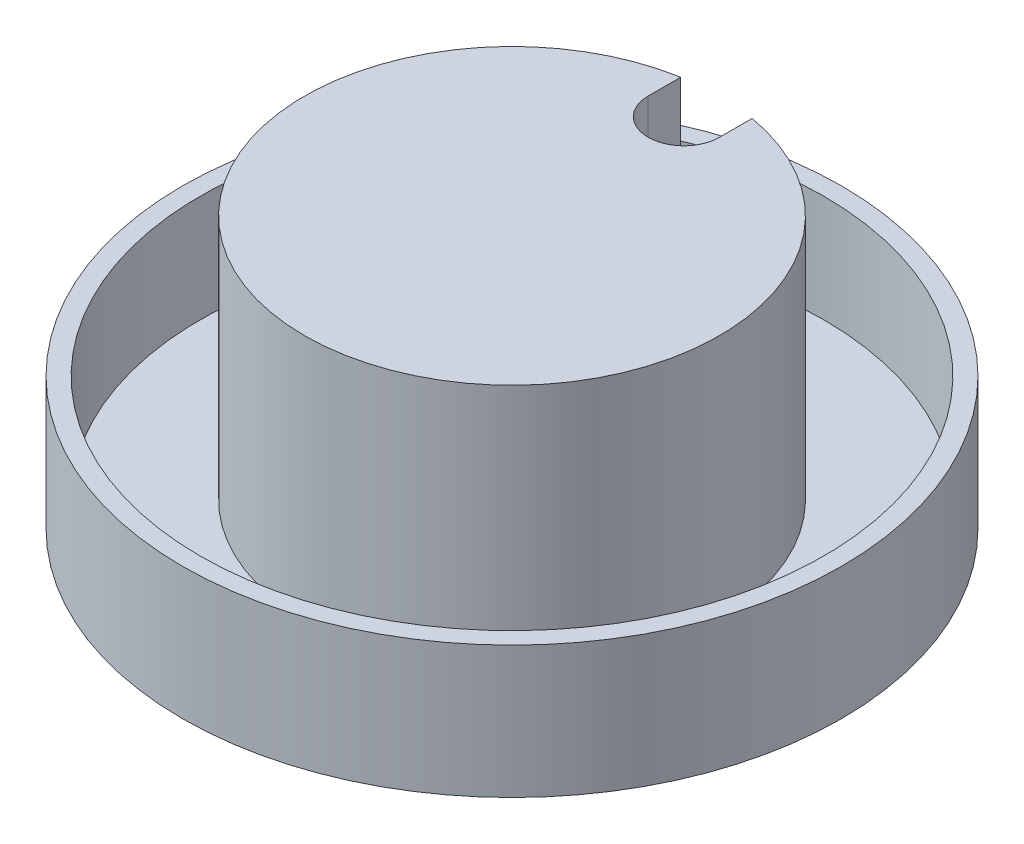
ISO-10303-21;
HEADER;
FILE_DESCRIPTION(('STEP AP214'),'2;1');
FILE_NAME('part.step','',(''),(''),'','','');
FILE_SCHEMA(('AUTOMOTIVE_DESIGN { 1 0 10303 214 1 1 1 1 }'));
ENDSEC;
DATA;
#1=APPLICATION_CONTEXT('core data for automotive mechanical design processes');
#2=APPLICATION_PROTOCOL_DEFINITION('international standard','automotive_design',2000,#1);
#3=PRODUCT_CONTEXT('',#1,'mechanical');
#4=PRODUCT('Part','Part','',(#3));
#5=PRODUCT_RELATED_PRODUCT_CATEGORY('part','',(#4));
#6=PRODUCT_DEFINITION_FORMATION('','',#4);
#7=PRODUCT_DEFINITION_CONTEXT('part definition',#1,'design');
#8=PRODUCT_DEFINITION('design','',#6,#7);
#9=PRODUCT_DEFINITION_SHAPE('','',#8);
#10=(LENGTH_UNIT() NAMED_UNIT(*) SI_UNIT(.MILLI.,.METRE.));
#11=(NAMED_UNIT(*) PLANE_ANGLE_UNIT() SI_UNIT($,.RADIAN.));
#12=(NAMED_UNIT(*) SI_UNIT($,.STERADIAN.) SOLID_ANGLE_UNIT());
#13=UNCERTAINTY_MEASURE_WITH_UNIT(LENGTH_MEASURE(1.E-05),#10,'distance_accuracy_value','');
#14=(GEOMETRIC_REPRESENTATION_CONTEXT(3) GLOBAL_UNCERTAINTY_ASSIGNED_CONTEXT((#13)) GLOBAL_UNIT_ASSIGNED_CONTEXT((#10,
#11,#12)) REPRESENTATION_CONTEXT('',''));
#15=CARTESIAN_POINT('',(0.,0.,0.));
#16=DIRECTION('',(0.,0.,1.));
#17=DIRECTION('',(1.,0.,0.));
#18=AXIS2_PLACEMENT_3D('',#15,#16,#17);
#19=CARTESIAN_POINT('',(-3.4,-8.659999892,-10.35));
#20=DIRECTION('',(1.,0.,0.));
#21=DIRECTION('',(0.,0.,-1.));
#22=AXIS2_PLACEMENT_3D('',#19,#20,#21);
#23=PLANE('',#22);
#24=DIRECTION('',(0.,0.,-1.));
#25=VECTOR('',#24,1.);
#26=CARTESIAN_POINT('',(-3.4,0.,-10.35));
#27=LINE('',#26,#25);
#28=CARTESIAN_POINT('',(-3.4,0.,-10.35));
#29=VERTEX_POINT('',#28);
#30=CARTESIAN_POINT('',(-3.4,0.,-11.0877761570414));
#31=VERTEX_POINT('',#30);
#32=EDGE_CURVE('E154',#29,#31,#27,.T.);
#33=ORIENTED_EDGE('',*,*,#32,.F.);
#34=DIRECTION('',(0.,1.,0.));
#35=VECTOR('',#34,1.);
#36=CARTESIAN_POINT('',(-3.4,-8.659999892,-10.35));
#37=LINE('',#36,#35);
#38=CARTESIAN_POINT('',(-3.4,14.809999892,-10.35));
#39=VERTEX_POINT('',#38);
#40=EDGE_CURVE('E163',#29,#39,#37,.T.);
#41=ORIENTED_EDGE('',*,*,#40,.T.);
#42=DIRECTION('',(0.,0.,-1.));
#43=VECTOR('',#42,1.);
#44=CARTESIAN_POINT('',(-3.4,14.809999892,-10.35));
#45=LINE('',#44,#43);
#46=CARTESIAN_POINT('',(-3.4,14.809999892,-11.0877761570414));
#47=VERTEX_POINT('',#46);
#48=EDGE_CURVE('E238',#39,#47,#45,.T.);
#49=ORIENTED_EDGE('',*,*,#48,.T.);
#50=DIRECTION('',(0.,-1.,0.));
#51=VECTOR('',#50,1.);
#52=CARTESIAN_POINT('',(-3.4,14.809999892,-11.0877761570414));
#53=LINE('',#52,#51);
#54=EDGE_CURVE('E165',#47,#31,#53,.T.);
#55=ORIENTED_EDGE('',*,*,#54,.T.);
#56=EDGE_LOOP('',(#33,#41,#49,#55));
#57=FACE_BOUND('',#56,.T.);
#58=ADVANCED_FACE('F69',(#57),#23,.F.);
#59=CARTESIAN_POINT('',(3.4,-8.659999892,-10.35));
#60=DIRECTION('',(1.,0.,0.));
#61=DIRECTION('',(0.,0.,-1.));
#62=AXIS2_PLACEMENT_3D('',#59,#60,#61);
#63=PLANE('',#62);
#64=DIRECTION('',(0.,1.,0.));
#65=VECTOR('',#64,1.);
#66=CARTESIAN_POINT('',(3.4,-8.659999892,-10.35));
#67=LINE('',#66,#65);
#68=CARTESIAN_POINT('',(3.4,0.,-10.35));
#69=VERTEX_POINT('',#68);
#70=CARTESIAN_POINT('',(3.4,14.809999892,-10.35));
#71=VERTEX_POINT('',#70);
#72=EDGE_CURVE('E174',#69,#71,#67,.T.);
#73=ORIENTED_EDGE('',*,*,#72,.F.);
#74=DIRECTION('',(0.,0.,-1.));
#75=VECTOR('',#74,1.);
#76=CARTESIAN_POINT('',(3.4,0.,-10.35));
#77=LINE('',#76,#75);
#78=CARTESIAN_POINT('',(3.4,0.,-11.0877761570414));
#79=VERTEX_POINT('',#78);
#80=EDGE_CURVE('E156',#69,#79,#77,.T.);
#81=ORIENTED_EDGE('',*,*,#80,.T.);
#82=DIRECTION('',(0.,-1.,0.));
#83=VECTOR('',#82,1.);
#84=CARTESIAN_POINT('',(3.4,14.809999892,-11.0877761570414));
#85=LINE('',#84,#83);
#86=CARTESIAN_POINT('',(3.4,14.809999892,-11.0877761570414));
#87=VERTEX_POINT('',#86);
#88=EDGE_CURVE('E191',#87,#79,#85,.T.);
#89=ORIENTED_EDGE('',*,*,#88,.F.);
#90=DIRECTION('',(0.,0.,-1.));
#91=VECTOR('',#90,1.);
#92=CARTESIAN_POINT('',(3.4,14.809999892,-10.35));
#93=LINE('',#92,#91);
#94=EDGE_CURVE('E235',#71,#87,#93,.T.);
#95=ORIENTED_EDGE('',*,*,#94,.F.);
#96=EDGE_LOOP('',(#73,#81,#89,#95));
#97=FACE_BOUND('',#96,.T.);
#98=ADVANCED_FACE('F275',(#97),#63,.T.);
#99=CARTESIAN_POINT('',(-2.15,-8.659999892,-10.35));
#100=DIRECTION('',(1.,0.,0.));
#101=DIRECTION('',(0.,0.,-1.));
#102=AXIS2_PLACEMENT_3D('',#99,#100,#101);
#103=PLANE('',#102);
#104=DIRECTION('',(0.,1.,0.));
#105=VECTOR('',#104,1.);
#106=CARTESIAN_POINT('',(-2.15,-8.659999892,-10.35));
#107=LINE('',#106,#105);
#108=CARTESIAN_POINT('',(-2.15,0.,-10.35));
#109=VERTEX_POINT('',#108);
#110=CARTESIAN_POINT('',(-2.15,16.31,-10.35));
#111=VERTEX_POINT('',#110);
#112=EDGE_CURVE('E224',#109,#111,#107,.T.);
#113=ORIENTED_EDGE('',*,*,#112,.F.);
#114=DIRECTION('',(0.,0.,1.));
#115=VECTOR('',#114,1.);
#116=CARTESIAN_POINT('',(-2.15,0.,-10.35));
#117=LINE('',#116,#115);
#118=CARTESIAN_POINT('',(-2.15,0.,-12.5));
#119=VERTEX_POINT('',#118);
#120=EDGE_CURVE('E247',#119,#109,#117,.T.);
#121=ORIENTED_EDGE('',*,*,#120,.F.);
#122=DIRECTION('',(0.,1.,0.));
#123=VECTOR('',#122,1.);
#124=CARTESIAN_POINT('',(-2.15,-8.659999892,-12.5));
#125=LINE('',#124,#123);
#126=CARTESIAN_POINT('',(-2.15,1.5,-12.5));
#127=VERTEX_POINT('',#126);
#128=EDGE_CURVE('E227',#119,#127,#125,.T.);
#129=ORIENTED_EDGE('',*,*,#128,.T.);
#130=DIRECTION('',(0.,0.,1.));
#131=VECTOR('',#130,1.);
#132=CARTESIAN_POINT('',(-2.15,1.5,-10.35));
#133=LINE('',#132,#131);
#134=CARTESIAN_POINT('',(-2.15,1.5,-12.3137118692943));
#135=VERTEX_POINT('',#134);
#136=EDGE_CURVE('E215',#127,#135,#133,.T.);
#137=ORIENTED_EDGE('',*,*,#136,.T.);
#138=DIRECTION('',(0.,1.,0.));
#139=VECTOR('',#138,1.);
#140=CARTESIAN_POINT('',(-2.15,1.5,-12.3137118692943));
#141=LINE('',#140,#139);
#142=CARTESIAN_POINT('',(-2.15,16.31,-12.3137118692943));
#143=VERTEX_POINT('',#142);
#144=EDGE_CURVE('E244',#135,#143,#141,.T.);
#145=ORIENTED_EDGE('',*,*,#144,.T.);
#146=DIRECTION('',(0.,0.,-1.));
#147=VECTOR('',#146,1.);
#148=CARTESIAN_POINT('',(-2.15,16.31,-10.35));
#149=LINE('',#148,#147);
#150=EDGE_CURVE('E214',#111,#143,#149,.T.);
#151=ORIENTED_EDGE('',*,*,#150,.F.);
#152=EDGE_LOOP('',(#113,#121,#129,#137,#145,#151));
#153=FACE_BOUND('',#152,.T.);
#154=ADVANCED_FACE('F250',(#153),#103,.T.);
#155=CARTESIAN_POINT('',(2.15,-8.659999892,-10.35));
#156=DIRECTION('',(1.,0.,0.));
#157=DIRECTION('',(0.,0.,-1.));
#158=AXIS2_PLACEMENT_3D('',#155,#156,#157);
#159=PLANE('',#158);
#160=DIRECTION('',(0.,0.,1.));
#161=VECTOR('',#160,1.);
#162=CARTESIAN_POINT('',(2.15,0.,-10.35));
#163=LINE('',#162,#161);
#164=CARTESIAN_POINT('',(2.15,0.,-12.5));
#165=VERTEX_POINT('',#164);
#166=CARTESIAN_POINT('',(2.15,0.,-10.35));
#167=VERTEX_POINT('',#166);
#168=EDGE_CURVE('E485',#165,#167,#163,.T.);
#169=ORIENTED_EDGE('',*,*,#168,.T.);
#170=DIRECTION('',(0.,1.,0.));
#171=VECTOR('',#170,1.);
#172=CARTESIAN_POINT('',(2.15,-8.659999892,-10.35));
#173=LINE('',#172,#171);
#174=CARTESIAN_POINT('',(2.15,16.31,-10.35));
#175=VERTEX_POINT('',#174);
#176=EDGE_CURVE('E210',#167,#175,#173,.T.);
#177=ORIENTED_EDGE('',*,*,#176,.T.);
#178=DIRECTION('',(0.,0.,-1.));
#179=VECTOR('',#178,1.);
#180=CARTESIAN_POINT('',(2.15,16.31,-10.35));
#181=LINE('',#180,#179);
#182=CARTESIAN_POINT('',(2.15,16.31,-12.3137118692943));
#183=VERTEX_POINT('',#182);
#184=EDGE_CURVE('E208',#175,#183,#181,.T.);
#185=ORIENTED_EDGE('',*,*,#184,.T.);
#186=DIRECTION('',(0.,1.,0.));
#187=VECTOR('',#186,1.);
#188=CARTESIAN_POINT('',(2.15,1.5,-12.3137118692943));
#189=LINE('',#188,#187);
#190=CARTESIAN_POINT('',(2.15,1.5,-12.3137118692943));
#191=VERTEX_POINT('',#190);
#192=EDGE_CURVE('E77',#191,#183,#189,.T.);
#193=ORIENTED_EDGE('',*,*,#192,.F.);
#194=DIRECTION('',(0.,0.,1.));
#195=VECTOR('',#194,1.);
#196=CARTESIAN_POINT('',(2.15,1.5,-10.35));
#197=LINE('',#196,#195);
#198=CARTESIAN_POINT('',(2.15,1.5,-12.5));
#199=VERTEX_POINT('',#198);
#200=EDGE_CURVE('E12',#199,#191,#197,.T.);
#201=ORIENTED_EDGE('',*,*,#200,.F.);
#202=DIRECTION('',(0.,1.,0.));
#203=VECTOR('',#202,1.);
#204=CARTESIAN_POINT('',(2.15,-8.659999892,-12.5));
#205=LINE('',#204,#203);
#206=EDGE_CURVE('E218',#165,#199,#205,.T.);
#207=ORIENTED_EDGE('',*,*,#206,.F.);
#208=EDGE_LOOP('',(#169,#177,#185,#193,#201,#207));
#209=FACE_BOUND('',#208,.T.);
#210=ADVANCED_FACE('F209',(#209),#159,.F.);
#211=CARTESIAN_POINT('',(0.,0.,0.));
#212=DIRECTION('',(0.,1.,0.));
#213=DIRECTION('',(0.,0.,1.));
#214=AXIS2_PLACEMENT_3D('',#211,#212,#213);
#215=PLANE('',#214);
#216=ORIENTED_EDGE('',*,*,#32,.T.);
#217=CARTESIAN_POINT('',(0.,0.,0.));
#218=DIRECTION('',(0.,-1.,0.));
#219=DIRECTION('',(0.,0.,-1.));
#220=AXIS2_PLACEMENT_3D('',#217,#218,#219);
#221=CIRCLE('',#220,11.5973609113736);
#222=EDGE_CURVE('E173',#79,#31,#221,.T.);
#223=ORIENTED_EDGE('',*,*,#222,.F.);
#224=ORIENTED_EDGE('',*,*,#80,.F.);
#225=CARTESIAN_POINT('',(0.,0.,-10.35));
#226=DIRECTION('',(0.,-1.,0.));
#227=DIRECTION('',(0.,0.,-1.));
#228=AXIS2_PLACEMENT_3D('',#225,#226,#227);
#229=CIRCLE('',#228,3.4);
#230=EDGE_CURVE('E84',#29,#69,#229,.T.);
#231=ORIENTED_EDGE('',*,*,#230,.F.);
#232=EDGE_LOOP('',(#216,#223,#224,#231));
#233=FACE_BOUND('',#232,.T.);
#234=CARTESIAN_POINT('',(0.,0.,0.));
#235=DIRECTION('',(0.,1.,0.));
#236=DIRECTION('',(0.,0.,1.));
#237=AXIS2_PLACEMENT_3D('',#234,#235,#236);
#238=CIRCLE('',#237,19.85);
#239=CARTESIAN_POINT('',(0.,0.,19.85));
#240=VERTEX_POINT('',#239);
#241=EDGE_CURVE('E187',#240,#240,#238,.T.);
#242=ORIENTED_EDGE('',*,*,#241,.F.);
#243=EDGE_LOOP('',(#242));
#244=FACE_BOUND('',#243,.T.);
#245=ADVANCED_FACE('F151',(#233,#244),#215,.F.);
#246=CARTESIAN_POINT('',(-3.4,16.31,-10.35));
#247=DIRECTION('',(0.,-1.,0.));
#248=DIRECTION('',(0.,0.,-1.));
#249=AXIS2_PLACEMENT_3D('',#246,#247,#248);
#250=PLANE('',#249);
#251=CARTESIAN_POINT('',(0.,16.31,0.));
#252=DIRECTION('',(0.,-1.,0.));
#253=DIRECTION('',(0.,0.,-1.));
#254=AXIS2_PLACEMENT_3D('',#251,#252,#253);
#255=CIRCLE('',#254,12.5);
#256=EDGE_CURVE('E203',#183,#143,#255,.T.);
#257=ORIENTED_EDGE('',*,*,#256,.F.);
#258=ORIENTED_EDGE('',*,*,#184,.F.);
#259=CARTESIAN_POINT('',(0.,16.31,-10.35));
#260=DIRECTION('',(0.,1.,0.));
#261=DIRECTION('',(0.,0.,1.));
#262=AXIS2_PLACEMENT_3D('',#259,#260,#261);
#263=CIRCLE('',#262,2.15);
#264=EDGE_CURVE('E229',#111,#175,#263,.T.);
#265=ORIENTED_EDGE('',*,*,#264,.F.);
#266=ORIENTED_EDGE('',*,*,#150,.T.);
#267=EDGE_LOOP('',(#257,#258,#265,#266));
#268=FACE_BOUND('',#267,.T.);
#269=ADVANCED_FACE('F264',(#268),#250,.F.);
#270=CARTESIAN_POINT('',(2.15,-8.659999892,-12.5));
#271=DIRECTION('',(0.,0.,-1.));
#272=DIRECTION('',(-1.,0.,0.));
#273=AXIS2_PLACEMENT_3D('',#270,#271,#272);
#274=PLANE('',#273);
#275=ORIENTED_EDGE('',*,*,#128,.F.);
#276=DIRECTION('',(1.,0.,0.));
#277=VECTOR('',#276,1.);
#278=CARTESIAN_POINT('',(2.15,0.,-12.5));
#279=LINE('',#278,#277);
#280=CARTESIAN_POINT('',(0.,0.,-12.5));
#281=VERTEX_POINT('',#280);
#282=EDGE_CURVE('E257',#119,#281,#279,.T.);
#283=ORIENTED_EDGE('',*,*,#282,.T.);
#284=DIRECTION('',(-1.,0.,0.));
#285=VECTOR('',#284,1.);
#286=CARTESIAN_POINT('',(2.15,0.,-12.5));
#287=LINE('',#286,#285);
#288=EDGE_CURVE('E481',#165,#281,#287,.T.);
#289=ORIENTED_EDGE('',*,*,#288,.F.);
#290=ORIENTED_EDGE('',*,*,#206,.T.);
#291=DIRECTION('',(1.,0.,0.));
#292=VECTOR('',#291,1.);
#293=CARTESIAN_POINT('',(2.15,1.5,-12.5));
#294=LINE('',#293,#292);
#295=EDGE_CURVE('E221',#127,#199,#294,.T.);
#296=ORIENTED_EDGE('',*,*,#295,.F.);
#297=EDGE_LOOP('',(#275,#283,#289,#290,#296));
#298=FACE_BOUND('',#297,.T.);
#299=ADVANCED_FACE('F255',(#298),#274,.F.);
#300=CARTESIAN_POINT('',(0.,1.5,0.));
#301=DIRECTION('',(0.,-1.,0.));
#302=DIRECTION('',(0.,0.,-1.));
#303=AXIS2_PLACEMENT_3D('',#300,#301,#302);
#304=PLANE('',#303);
#305=CARTESIAN_POINT('',(0.,1.5,0.));
#306=DIRECTION('',(0.,-1.,0.));
#307=DIRECTION('',(0.,0.,-1.));
#308=AXIS2_PLACEMENT_3D('',#305,#306,#307);
#309=CIRCLE('',#308,18.78);
#310=CARTESIAN_POINT('',(0.,1.5,-18.78));
#311=VERTEX_POINT('',#310);
#312=EDGE_CURVE('E176',#311,#311,#309,.T.);
#313=ORIENTED_EDGE('',*,*,#312,.F.);
#314=EDGE_LOOP('',(#313));
#315=FACE_BOUND('',#314,.T.);
#316=CARTESIAN_POINT('',(0.,1.5,0.));
#317=DIRECTION('',(0.,-1.,0.));
#318=DIRECTION('',(0.,0.,-1.));
#319=AXIS2_PLACEMENT_3D('',#316,#317,#318);
#320=CIRCLE('',#319,12.5);
#321=EDGE_CURVE('E178',#191,#135,#320,.T.);
#322=ORIENTED_EDGE('',*,*,#321,.T.);
#323=ORIENTED_EDGE('',*,*,#136,.F.);
#324=ORIENTED_EDGE('',*,*,#295,.T.);
#325=ORIENTED_EDGE('',*,*,#200,.T.);
#326=EDGE_LOOP('',(#322,#323,#324,#325));
#327=FACE_BOUND('',#326,.T.);
#328=ADVANCED_FACE('F241',(#315,#327),#304,.F.);
#329=CARTESIAN_POINT('',(0.,14.809999892,0.));
#330=DIRECTION('',(0.,-1.,0.));
#331=DIRECTION('',(0.,0.,-1.));
#332=AXIS2_PLACEMENT_3D('',#329,#330,#331);
#333=CYLINDRICAL_SURFACE('',#332,11.5973609113736);
#334=ORIENTED_EDGE('',*,*,#54,.F.);
#335=CARTESIAN_POINT('',(0.,14.809999892,0.));
#336=DIRECTION('',(0.,-1.,0.));
#337=DIRECTION('',(0.,0.,-1.));
#338=AXIS2_PLACEMENT_3D('',#335,#336,#337);
#339=CIRCLE('',#338,11.5973609113736);
#340=EDGE_CURVE('E231',#87,#47,#339,.T.);
#341=ORIENTED_EDGE('',*,*,#340,.F.);
#342=ORIENTED_EDGE('',*,*,#88,.T.);
#343=ORIENTED_EDGE('',*,*,#222,.T.);
#344=EDGE_LOOP('',(#334,#341,#342,#343));
#345=FACE_BOUND('',#344,.T.);
#346=ADVANCED_FACE('F285',(#345),#333,.F.);
#347=CARTESIAN_POINT('',(0.,7.95,0.));
#348=DIRECTION('',(0.,-1.,0.));
#349=DIRECTION('',(0.,0.,-1.));
#350=AXIS2_PLACEMENT_3D('',#347,#348,#349);
#351=CYLINDRICAL_SURFACE('',#350,18.78);
#352=CARTESIAN_POINT('',(0.,7.95,0.));
#353=DIRECTION('',(0.,1.,0.));
#354=DIRECTION('',(0.,0.,1.));
#355=AXIS2_PLACEMENT_3D('',#352,#353,#354);
#356=CIRCLE('',#355,18.78);
#357=CARTESIAN_POINT('',(0.,7.95,18.78));
#358=VERTEX_POINT('',#357);
#359=EDGE_CURVE('E184',#358,#358,#356,.T.);
#360=ORIENTED_EDGE('',*,*,#359,.T.);
#361=EDGE_LOOP('',(#360));
#362=FACE_BOUND('',#361,.T.);
#363=ORIENTED_EDGE('',*,*,#312,.T.);
#364=EDGE_LOOP('',(#363));
#365=FACE_BOUND('',#364,.T.);
#366=ADVANCED_FACE('F288',(#362,#365),#351,.F.);
#367=CARTESIAN_POINT('',(0.,7.95,0.));
#368=DIRECTION('',(0.,1.,0.));
#369=DIRECTION('',(0.,0.,1.));
#370=AXIS2_PLACEMENT_3D('',#367,#368,#369);
#371=PLANE('',#370);
#372=CARTESIAN_POINT('',(0.,7.95,0.));
#373=DIRECTION('',(0.,1.,0.));
#374=DIRECTION('',(0.,0.,1.));
#375=AXIS2_PLACEMENT_3D('',#372,#373,#374);
#376=CIRCLE('',#375,19.85);
#377=CARTESIAN_POINT('',(0.,7.95,19.85));
#378=VERTEX_POINT('',#377);
#379=EDGE_CURVE('E188',#378,#378,#376,.T.);
#380=ORIENTED_EDGE('',*,*,#379,.T.);
#381=EDGE_LOOP('',(#380));
#382=FACE_BOUND('',#381,.T.);
#383=ORIENTED_EDGE('',*,*,#359,.F.);
#384=EDGE_LOOP('',(#383));
#385=FACE_BOUND('',#384,.T.);
#386=ADVANCED_FACE('F295',(#382,#385),#371,.T.);
#387=CARTESIAN_POINT('',(0.,7.95,0.));
#388=DIRECTION('',(0.,-1.,0.));
#389=DIRECTION('',(0.,0.,-1.));
#390=AXIS2_PLACEMENT_3D('',#387,#388,#389);
#391=CYLINDRICAL_SURFACE('',#390,19.85);
#392=ORIENTED_EDGE('',*,*,#379,.F.);
#393=EDGE_LOOP('',(#392));
#394=FACE_BOUND('',#393,.T.);
#395=ORIENTED_EDGE('',*,*,#241,.T.);
#396=EDGE_LOOP('',(#395));
#397=FACE_BOUND('',#396,.T.);
#398=ADVANCED_FACE('F71',(#394,#397),#391,.T.);
#399=CARTESIAN_POINT('',(0.,-8.659999892,-10.35));
#400=DIRECTION('',(0.,1.,0.));
#401=DIRECTION('',(0.,0.,1.));
#402=AXIS2_PLACEMENT_3D('',#399,#400,#401);
#403=CYLINDRICAL_SURFACE('',#402,3.4);
#404=ORIENTED_EDGE('',*,*,#230,.T.);
#405=ORIENTED_EDGE('',*,*,#72,.T.);
#406=CARTESIAN_POINT('',(0.,14.809999892,-10.35));
#407=DIRECTION('',(0.,-1.,0.));
#408=DIRECTION('',(0.,0.,-1.));
#409=AXIS2_PLACEMENT_3D('',#406,#407,#408);
#410=CIRCLE('',#409,3.4);
#411=EDGE_CURVE('E171',#39,#71,#410,.F.);
#412=ORIENTED_EDGE('',*,*,#411,.F.);
#413=ORIENTED_EDGE('',*,*,#40,.F.);
#414=EDGE_LOOP('',(#404,#405,#412,#413));
#415=FACE_BOUND('',#414,.T.);
#416=CARTESIAN_POINT('',(0.,-14.,-10.35));
#417=DIRECTION('',(0.,-1.,0.));
#418=DIRECTION('',(0.,0.,-1.));
#419=AXIS2_PLACEMENT_3D('',#416,#417,#418);
#420=CIRCLE('',#419,3.4);
#421=CARTESIAN_POINT('',(0.,-14.,-13.75));
#422=VERTEX_POINT('',#421);
#423=EDGE_CURVE('E158',#422,#422,#420,.T.);
#424=ORIENTED_EDGE('',*,*,#423,.F.);
#425=EDGE_LOOP('',(#424));
#426=FACE_BOUND('',#425,.T.);
#427=ADVANCED_FACE('F168',(#415,#426),#403,.T.);
#428=CARTESIAN_POINT('',(0.,14.809999892,0.));
#429=DIRECTION('',(0.,-1.,0.));
#430=DIRECTION('',(0.,0.,-1.));
#431=AXIS2_PLACEMENT_3D('',#428,#429,#430);
#432=PLANE('',#431);
#433=ORIENTED_EDGE('',*,*,#48,.F.);
#434=ORIENTED_EDGE('',*,*,#411,.T.);
#435=ORIENTED_EDGE('',*,*,#94,.T.);
#436=ORIENTED_EDGE('',*,*,#340,.T.);
#437=EDGE_LOOP('',(#433,#434,#435,#436));
#438=FACE_BOUND('',#437,.T.);
#439=ADVANCED_FACE('F284',(#438),#432,.T.);
#440=CARTESIAN_POINT('',(0.,16.31,0.));
#441=DIRECTION('',(0.,-1.,0.));
#442=DIRECTION('',(0.,0.,-1.));
#443=AXIS2_PLACEMENT_3D('',#440,#441,#442);
#444=CYLINDRICAL_SURFACE('',#443,12.5);
#445=ORIENTED_EDGE('',*,*,#256,.T.);
#446=ORIENTED_EDGE('',*,*,#144,.F.);
#447=ORIENTED_EDGE('',*,*,#321,.F.);
#448=ORIENTED_EDGE('',*,*,#192,.T.);
#449=EDGE_LOOP('',(#445,#446,#447,#448));
#450=FACE_BOUND('',#449,.T.);
#451=ADVANCED_FACE('F201',(#450),#444,.T.);
#452=CARTESIAN_POINT('',(0.,-8.659999892,-10.35));
#453=DIRECTION('',(0.,1.,0.));
#454=DIRECTION('',(0.,0.,1.));
#455=AXIS2_PLACEMENT_3D('',#452,#453,#454);
#456=CYLINDRICAL_SURFACE('',#455,2.15);
#457=CARTESIAN_POINT('',(0.,0.,-10.35));
#458=DIRECTION('',(0.,-1.,0.));
#459=DIRECTION('',(0.,0.,-1.));
#460=AXIS2_PLACEMENT_3D('',#457,#458,#459);
#461=CIRCLE('',#460,2.15);
#462=EDGE_CURVE('E166',#109,#281,#461,.T.);
#463=ORIENTED_EDGE('',*,*,#462,.F.);
#464=ORIENTED_EDGE('',*,*,#112,.T.);
#465=ORIENTED_EDGE('',*,*,#264,.T.);
#466=ORIENTED_EDGE('',*,*,#176,.F.);
#467=EDGE_CURVE('E92',#281,#167,#461,.T.);
#468=ORIENTED_EDGE('',*,*,#467,.F.);
#469=EDGE_LOOP('',(#463,#464,#465,#466,#468));
#470=FACE_BOUND('',#469,.T.);
#471=CARTESIAN_POINT('',(0.,-14.,-10.35));
#472=DIRECTION('',(0.,-1.,0.));
#473=DIRECTION('',(0.,0.,-1.));
#474=AXIS2_PLACEMENT_3D('',#471,#472,#473);
#475=CIRCLE('',#474,2.15);
#476=CARTESIAN_POINT('',(0.,-14.,-12.5));
#477=VERTEX_POINT('',#476);
#478=EDGE_CURVE('E159',#477,#477,#475,.T.);
#479=ORIENTED_EDGE('',*,*,#478,.T.);
#480=EDGE_LOOP('',(#479));
#481=FACE_BOUND('',#480,.T.);
#482=ADVANCED_FACE('F262',(#470,#481),#456,.F.);
#483=CARTESIAN_POINT('',(0.,0.,-10.35));
#484=DIRECTION('',(0.,-1.,0.));
#485=DIRECTION('',(0.,0.,-1.));
#486=AXIS2_PLACEMENT_3D('',#483,#484,#485);
#487=PLANE('',#486);
#488=ORIENTED_EDGE('',*,*,#120,.T.);
#489=ORIENTED_EDGE('',*,*,#462,.T.);
#490=ORIENTED_EDGE('',*,*,#282,.F.);
#491=EDGE_LOOP('',(#488,#489,#490));
#492=FACE_BOUND('',#491,.T.);
#493=ADVANCED_FACE('F338',(#492),#487,.F.);
#494=ORIENTED_EDGE('',*,*,#467,.T.);
#495=ORIENTED_EDGE('',*,*,#168,.F.);
#496=ORIENTED_EDGE('',*,*,#288,.T.);
#497=EDGE_LOOP('',(#494,#495,#496));
#498=FACE_BOUND('',#497,.T.);
#499=ADVANCED_FACE('F346',(#498),#487,.F.);
#500=CARTESIAN_POINT('',(0.,-14.,-10.35));
#501=DIRECTION('',(0.,-1.,0.));
#502=DIRECTION('',(0.,0.,-1.));
#503=AXIS2_PLACEMENT_3D('',#500,#501,#502);
#504=PLANE('',#503);
#505=ORIENTED_EDGE('',*,*,#423,.T.);
#506=EDGE_LOOP('',(#505));
#507=FACE_BOUND('',#506,.T.);
#508=ORIENTED_EDGE('',*,*,#478,.F.);
#509=EDGE_LOOP('',(#508));
#510=FACE_BOUND('',#509,.T.);
#511=ADVANCED_FACE('F354',(#507,#510),#504,.T.);
#512=CLOSED_SHELL('',(#58,#98,#154,#210,#245,#269,#299,#328,#346,#366,#386,#398,#427,#439,#451,
#482,#493,#499,#511));
#513=MANIFOLD_SOLID_BREP('B2',#512);
#514=ADVANCED_BREP_SHAPE_REPRESENTATION('',(#18,#513),#14);
#515=SHAPE_DEFINITION_REPRESENTATION(#9,#514);
ENDSEC;
END-ISO-10303-21;
